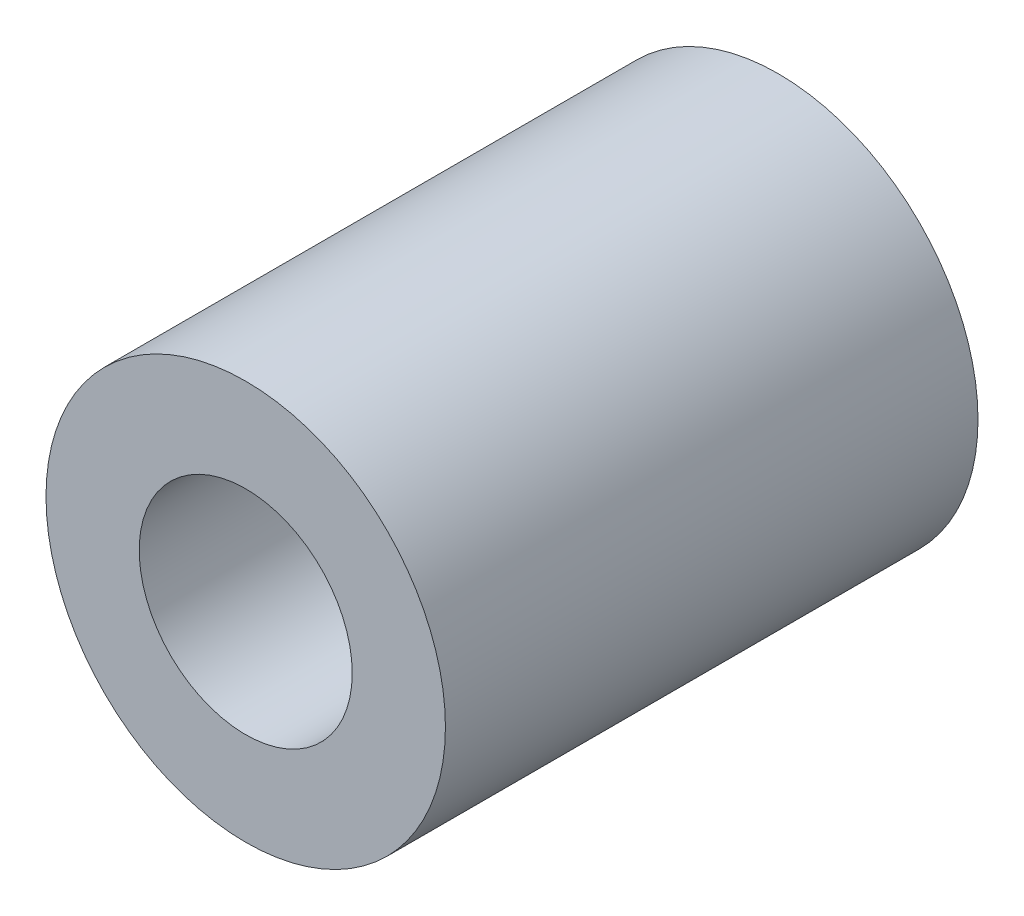
ISO-10303-21;
HEADER;
FILE_DESCRIPTION(('STEP AP214'),'2;1');
FILE_NAME('part.step','',(''),(''),'','','');
FILE_SCHEMA(('AUTOMOTIVE_DESIGN { 1 0 10303 214 1 1 1 1 }'));
ENDSEC;
DATA;
#1=APPLICATION_CONTEXT('core data for automotive mechanical design processes');
#2=APPLICATION_PROTOCOL_DEFINITION('international standard','automotive_design',2000,#1);
#3=PRODUCT_CONTEXT('',#1,'mechanical');
#4=PRODUCT('Part','Part','',(#3));
#5=PRODUCT_RELATED_PRODUCT_CATEGORY('part','',(#4));
#6=PRODUCT_DEFINITION_FORMATION('','',#4);
#7=PRODUCT_DEFINITION_CONTEXT('part definition',#1,'design');
#8=PRODUCT_DEFINITION('design','',#6,#7);
#9=PRODUCT_DEFINITION_SHAPE('','',#8);
#10=(LENGTH_UNIT() NAMED_UNIT(*) SI_UNIT(.MILLI.,.METRE.));
#11=(NAMED_UNIT(*) PLANE_ANGLE_UNIT() SI_UNIT($,.RADIAN.));
#12=(NAMED_UNIT(*) SI_UNIT($,.STERADIAN.) SOLID_ANGLE_UNIT());
#13=UNCERTAINTY_MEASURE_WITH_UNIT(LENGTH_MEASURE(1.E-05),#10,'distance_accuracy_value','');
#14=(GEOMETRIC_REPRESENTATION_CONTEXT(3) GLOBAL_UNCERTAINTY_ASSIGNED_CONTEXT((#13)) GLOBAL_UNIT_ASSIGNED_CONTEXT((#10,
#11,#12)) REPRESENTATION_CONTEXT('',''));
#15=CARTESIAN_POINT('',(0.,0.,0.));
#16=DIRECTION('',(0.,0.,1.));
#17=DIRECTION('',(1.,0.,0.));
#18=AXIS2_PLACEMENT_3D('',#15,#16,#17);
#19=CARTESIAN_POINT('',(0.,0.,8.));
#20=DIRECTION('',(0.,0.,1.));
#21=DIRECTION('',(1.,0.,0.));
#22=AXIS2_PLACEMENT_3D('',#19,#20,#21);
#23=PLANE('',#22);
#24=CARTESIAN_POINT('',(0.,0.,8.));
#25=DIRECTION('',(0.,0.,1.));
#26=DIRECTION('',(1.,0.,0.));
#27=AXIS2_PLACEMENT_3D('',#24,#25,#26);
#28=CIRCLE('',#27,3.);
#29=CARTESIAN_POINT('',(3.,0.,8.));
#30=VERTEX_POINT('',#29);
#31=EDGE_CURVE('E10',#30,#30,#28,.T.);
#32=ORIENTED_EDGE('',*,*,#31,.T.);
#33=EDGE_LOOP('',(#32));
#34=FACE_BOUND('',#33,.T.);
#35=CARTESIAN_POINT('',(0.,0.,8.));
#36=DIRECTION('',(0.,0.,1.));
#37=DIRECTION('',(1.,0.,0.));
#38=AXIS2_PLACEMENT_3D('',#35,#36,#37);
#39=CIRCLE('',#38,1.6);
#40=CARTESIAN_POINT('',(1.6,0.,8.));
#41=VERTEX_POINT('',#40);
#42=EDGE_CURVE('E35',#41,#41,#39,.T.);
#43=ORIENTED_EDGE('',*,*,#42,.F.);
#44=EDGE_LOOP('',(#43));
#45=FACE_BOUND('',#44,.T.);
#46=ADVANCED_FACE('F24',(#34,#45),#23,.T.);
#47=CARTESIAN_POINT('',(0.,0.,0.));
#48=DIRECTION('',(0.,0.,1.));
#49=DIRECTION('',(1.,0.,0.));
#50=AXIS2_PLACEMENT_3D('',#47,#48,#49);
#51=PLANE('',#50);
#52=CARTESIAN_POINT('',(0.,0.,0.));
#53=DIRECTION('',(0.,0.,1.));
#54=DIRECTION('',(1.,0.,0.));
#55=AXIS2_PLACEMENT_3D('',#52,#53,#54);
#56=CIRCLE('',#55,3.);
#57=CARTESIAN_POINT('',(3.,0.,0.));
#58=VERTEX_POINT('',#57);
#59=EDGE_CURVE('E31',#58,#58,#56,.T.);
#60=ORIENTED_EDGE('',*,*,#59,.F.);
#61=EDGE_LOOP('',(#60));
#62=FACE_BOUND('',#61,.T.);
#63=CARTESIAN_POINT('',(0.,0.,0.));
#64=DIRECTION('',(0.,0.,1.));
#65=DIRECTION('',(1.,0.,0.));
#66=AXIS2_PLACEMENT_3D('',#63,#64,#65);
#67=CIRCLE('',#66,1.6);
#68=CARTESIAN_POINT('',(1.6,0.,0.));
#69=VERTEX_POINT('',#68);
#70=EDGE_CURVE('E39',#69,#69,#67,.T.);
#71=ORIENTED_EDGE('',*,*,#70,.T.);
#72=EDGE_LOOP('',(#71));
#73=FACE_BOUND('',#72,.T.);
#74=ADVANCED_FACE('F45',(#62,#73),#51,.F.);
#75=CARTESIAN_POINT('',(0.,0.,8.));
#76=DIRECTION('',(0.,0.,-1.));
#77=DIRECTION('',(-1.,0.,0.));
#78=AXIS2_PLACEMENT_3D('',#75,#76,#77);
#79=CYLINDRICAL_SURFACE('',#78,3.);
#80=ORIENTED_EDGE('',*,*,#31,.F.);
#81=EDGE_LOOP('',(#80));
#82=FACE_BOUND('',#81,.T.);
#83=ORIENTED_EDGE('',*,*,#59,.T.);
#84=EDGE_LOOP('',(#83));
#85=FACE_BOUND('',#84,.T.);
#86=ADVANCED_FACE('F26',(#82,#85),#79,.T.);
#87=CARTESIAN_POINT('',(0.,0.,8.));
#88=DIRECTION('',(0.,0.,-1.));
#89=DIRECTION('',(-1.,0.,0.));
#90=AXIS2_PLACEMENT_3D('',#87,#88,#89);
#91=CYLINDRICAL_SURFACE('',#90,1.6);
#92=ORIENTED_EDGE('',*,*,#42,.T.);
#93=EDGE_LOOP('',(#92));
#94=FACE_BOUND('',#93,.T.);
#95=ORIENTED_EDGE('',*,*,#70,.F.);
#96=EDGE_LOOP('',(#95));
#97=FACE_BOUND('',#96,.T.);
#98=ADVANCED_FACE('F47',(#94,#97),#91,.F.);
#99=CLOSED_SHELL('',(#46,#74,#86,#98));
#100=MANIFOLD_SOLID_BREP('B2',#99);
#101=ADVANCED_BREP_SHAPE_REPRESENTATION('',(#18,#100),#14);
#102=SHAPE_DEFINITION_REPRESENTATION(#9,#101);
ENDSEC;
END-ISO-10303-21;
